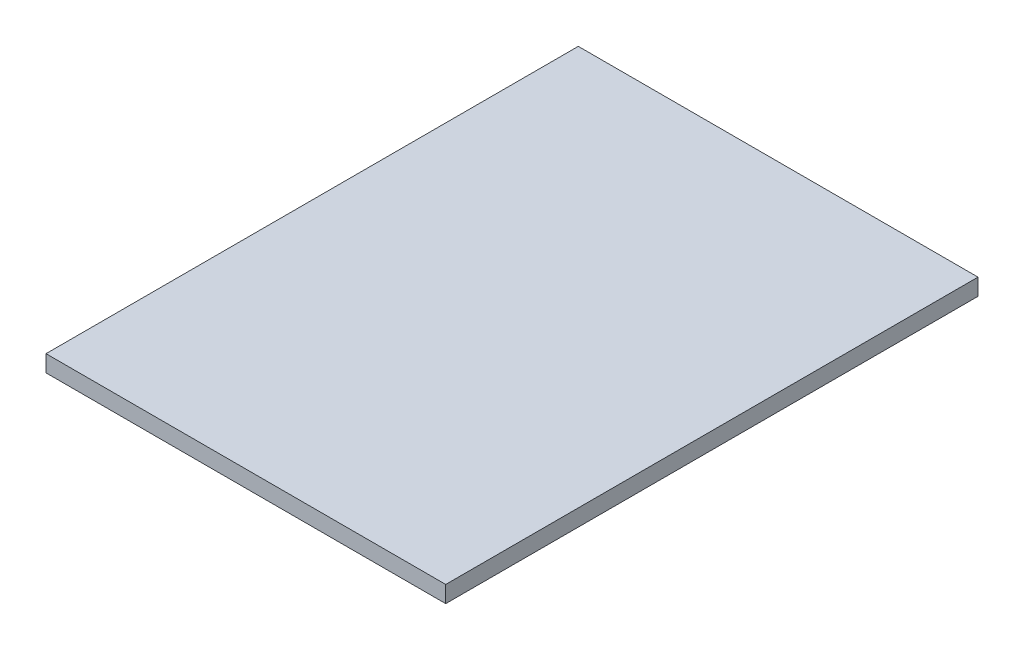
ISO-10303-21;
HEADER;
FILE_DESCRIPTION(('STEP AP214'),'2;1');
FILE_NAME('part.step','',(''),(''),'','','');
FILE_SCHEMA(('AUTOMOTIVE_DESIGN { 1 0 10303 214 1 1 1 1 }'));
ENDSEC;
DATA;
#1=APPLICATION_CONTEXT('core data for automotive mechanical design processes');
#2=APPLICATION_PROTOCOL_DEFINITION('international standard','automotive_design',2000,#1);
#3=PRODUCT_CONTEXT('',#1,'mechanical');
#4=PRODUCT('Part','Part','',(#3));
#5=PRODUCT_RELATED_PRODUCT_CATEGORY('part','',(#4));
#6=PRODUCT_DEFINITION_FORMATION('','',#4);
#7=PRODUCT_DEFINITION_CONTEXT('part definition',#1,'design');
#8=PRODUCT_DEFINITION('design','',#6,#7);
#9=PRODUCT_DEFINITION_SHAPE('','',#8);
#10=(LENGTH_UNIT() NAMED_UNIT(*) SI_UNIT(.MILLI.,.METRE.));
#11=(NAMED_UNIT(*) PLANE_ANGLE_UNIT() SI_UNIT($,.RADIAN.));
#12=(NAMED_UNIT(*) SI_UNIT($,.STERADIAN.) SOLID_ANGLE_UNIT());
#13=UNCERTAINTY_MEASURE_WITH_UNIT(LENGTH_MEASURE(1.E-05),#10,'distance_accuracy_value','');
#14=(GEOMETRIC_REPRESENTATION_CONTEXT(3) GLOBAL_UNCERTAINTY_ASSIGNED_CONTEXT((#13)) GLOBAL_UNIT_ASSIGNED_CONTEXT((#10,
#11,#12)) REPRESENTATION_CONTEXT('',''));
#15=CARTESIAN_POINT('',(0.,0.,0.));
#16=DIRECTION('',(0.,0.,1.));
#17=DIRECTION('',(1.,0.,0.));
#18=AXIS2_PLACEMENT_3D('',#15,#16,#17);
#19=CARTESIAN_POINT('',(0.,6.35,0.));
#20=DIRECTION('',(1.,0.,0.));
#21=DIRECTION('',(0.,0.,-1.));
#22=AXIS2_PLACEMENT_3D('',#19,#20,#21);
#23=PLANE('',#22);
#24=DIRECTION('',(0.,0.,1.));
#25=VECTOR('',#24,1.);
#26=CARTESIAN_POINT('',(0.,0.,0.));
#27=LINE('',#26,#25);
#28=CARTESIAN_POINT('',(0.,0.,-202.946));
#29=VERTEX_POINT('',#28);
#30=CARTESIAN_POINT('',(0.,0.,0.));
#31=VERTEX_POINT('',#30);
#32=EDGE_CURVE('E96',#29,#31,#27,.T.);
#33=ORIENTED_EDGE('',*,*,#32,.T.);
#34=DIRECTION('',(0.,-1.,0.));
#35=VECTOR('',#34,1.);
#36=CARTESIAN_POINT('',(0.,6.35,0.));
#37=LINE('',#36,#35);
#38=CARTESIAN_POINT('',(0.,6.35,0.));
#39=VERTEX_POINT('',#38);
#40=EDGE_CURVE('E11',#39,#31,#37,.T.);
#41=ORIENTED_EDGE('',*,*,#40,.F.);
#42=DIRECTION('',(0.,0.,1.));
#43=VECTOR('',#42,1.);
#44=CARTESIAN_POINT('',(0.,6.35,0.));
#45=LINE('',#44,#43);
#46=CARTESIAN_POINT('',(0.,6.35,-202.946));
#47=VERTEX_POINT('',#46);
#48=EDGE_CURVE('E84',#47,#39,#45,.T.);
#49=ORIENTED_EDGE('',*,*,#48,.F.);
#50=DIRECTION('',(0.,-1.,0.));
#51=VECTOR('',#50,1.);
#52=CARTESIAN_POINT('',(0.,6.35,-202.946));
#53=LINE('',#52,#51);
#54=EDGE_CURVE('E92',#47,#29,#53,.T.);
#55=ORIENTED_EDGE('',*,*,#54,.T.);
#56=EDGE_LOOP('',(#33,#41,#49,#55));
#57=FACE_BOUND('',#56,.T.);
#58=ADVANCED_FACE('F33',(#57),#23,.F.);
#59=CARTESIAN_POINT('',(0.,6.35,0.));
#60=DIRECTION('',(0.,0.,-1.));
#61=DIRECTION('',(-1.,0.,0.));
#62=AXIS2_PLACEMENT_3D('',#59,#60,#61);
#63=PLANE('',#62);
#64=DIRECTION('',(1.,0.,0.));
#65=VECTOR('',#64,1.);
#66=CARTESIAN_POINT('',(0.,0.,0.));
#67=LINE('',#66,#65);
#68=CARTESIAN_POINT('',(152.4,0.,0.));
#69=VERTEX_POINT('',#68);
#70=EDGE_CURVE('E88',#31,#69,#67,.T.);
#71=ORIENTED_EDGE('',*,*,#70,.T.);
#72=DIRECTION('',(0.,-1.,0.));
#73=VECTOR('',#72,1.);
#74=CARTESIAN_POINT('',(152.4,6.35,0.));
#75=LINE('',#74,#73);
#76=CARTESIAN_POINT('',(152.4,6.35,0.));
#77=VERTEX_POINT('',#76);
#78=EDGE_CURVE('E41',#77,#69,#75,.T.);
#79=ORIENTED_EDGE('',*,*,#78,.F.);
#80=DIRECTION('',(1.,0.,0.));
#81=VECTOR('',#80,1.);
#82=CARTESIAN_POINT('',(0.,6.35,0.));
#83=LINE('',#82,#81);
#84=EDGE_CURVE('E79',#39,#77,#83,.T.);
#85=ORIENTED_EDGE('',*,*,#84,.F.);
#86=ORIENTED_EDGE('',*,*,#40,.T.);
#87=EDGE_LOOP('',(#71,#79,#85,#86));
#88=FACE_BOUND('',#87,.T.);
#89=ADVANCED_FACE('F87',(#88),#63,.F.);
#90=CARTESIAN_POINT('',(152.4,6.35,0.));
#91=DIRECTION('',(-1.,0.,0.));
#92=DIRECTION('',(0.,0.,1.));
#93=AXIS2_PLACEMENT_3D('',#90,#91,#92);
#94=PLANE('',#93);
#95=DIRECTION('',(0.,0.,-1.));
#96=VECTOR('',#95,1.);
#97=CARTESIAN_POINT('',(152.4,0.,0.));
#98=LINE('',#97,#96);
#99=CARTESIAN_POINT('',(152.4,0.,-202.946));
#100=VERTEX_POINT('',#99);
#101=EDGE_CURVE('E66',#69,#100,#98,.T.);
#102=ORIENTED_EDGE('',*,*,#101,.T.);
#103=DIRECTION('',(0.,-1.,0.));
#104=VECTOR('',#103,1.);
#105=CARTESIAN_POINT('',(152.4,6.35,-202.946));
#106=LINE('',#105,#104);
#107=CARTESIAN_POINT('',(152.4,6.35,-202.946));
#108=VERTEX_POINT('',#107);
#109=EDGE_CURVE('E89',#108,#100,#106,.T.);
#110=ORIENTED_EDGE('',*,*,#109,.F.);
#111=DIRECTION('',(0.,0.,-1.));
#112=VECTOR('',#111,1.);
#113=CARTESIAN_POINT('',(152.4,6.35,0.));
#114=LINE('',#113,#112);
#115=EDGE_CURVE('E82',#77,#108,#114,.T.);
#116=ORIENTED_EDGE('',*,*,#115,.F.);
#117=ORIENTED_EDGE('',*,*,#78,.T.);
#118=EDGE_LOOP('',(#102,#110,#116,#117));
#119=FACE_BOUND('',#118,.T.);
#120=ADVANCED_FACE('F90',(#119),#94,.F.);
#121=CARTESIAN_POINT('',(0.,6.35,-202.946));
#122=DIRECTION('',(0.,0.,1.));
#123=DIRECTION('',(1.,0.,0.));
#124=AXIS2_PLACEMENT_3D('',#121,#122,#123);
#125=PLANE('',#124);
#126=DIRECTION('',(-1.,0.,0.));
#127=VECTOR('',#126,1.);
#128=CARTESIAN_POINT('',(0.,0.,-202.946));
#129=LINE('',#128,#127);
#130=EDGE_CURVE('E72',#100,#29,#129,.T.);
#131=ORIENTED_EDGE('',*,*,#130,.T.);
#132=ORIENTED_EDGE('',*,*,#54,.F.);
#133=DIRECTION('',(-1.,0.,0.));
#134=VECTOR('',#133,1.);
#135=CARTESIAN_POINT('',(0.,6.35,-202.946));
#136=LINE('',#135,#134);
#137=EDGE_CURVE('E49',#108,#47,#136,.T.);
#138=ORIENTED_EDGE('',*,*,#137,.F.);
#139=ORIENTED_EDGE('',*,*,#109,.T.);
#140=EDGE_LOOP('',(#131,#132,#138,#139));
#141=FACE_BOUND('',#140,.T.);
#142=ADVANCED_FACE('F103',(#141),#125,.F.);
#143=CARTESIAN_POINT('',(0.,6.35,0.));
#144=DIRECTION('',(0.,-1.,0.));
#145=DIRECTION('',(0.,0.,-1.));
#146=AXIS2_PLACEMENT_3D('',#143,#144,#145);
#147=PLANE('',#146);
#148=ORIENTED_EDGE('',*,*,#48,.T.);
#149=ORIENTED_EDGE('',*,*,#84,.T.);
#150=ORIENTED_EDGE('',*,*,#115,.T.);
#151=ORIENTED_EDGE('',*,*,#137,.T.);
#152=EDGE_LOOP('',(#148,#149,#150,#151));
#153=FACE_BOUND('',#152,.T.);
#154=ADVANCED_FACE('F80',(#153),#147,.F.);
#155=CARTESIAN_POINT('',(0.,0.,0.));
#156=DIRECTION('',(0.,-1.,0.));
#157=DIRECTION('',(0.,0.,-1.));
#158=AXIS2_PLACEMENT_3D('',#155,#156,#157);
#159=PLANE('',#158);
#160=ORIENTED_EDGE('',*,*,#32,.F.);
#161=ORIENTED_EDGE('',*,*,#130,.F.);
#162=ORIENTED_EDGE('',*,*,#101,.F.);
#163=ORIENTED_EDGE('',*,*,#70,.F.);
#164=EDGE_LOOP('',(#160,#161,#162,#163));
#165=FACE_BOUND('',#164,.T.);
#166=ADVANCED_FACE('F106',(#165),#159,.T.);
#167=CLOSED_SHELL('',(#58,#89,#120,#142,#154,#166));
#168=MANIFOLD_SOLID_BREP('B2',#167);
#169=ADVANCED_BREP_SHAPE_REPRESENTATION('',(#18,#168),#14);
#170=SHAPE_DEFINITION_REPRESENTATION(#9,#169);
ENDSEC;
END-ISO-10303-21;
